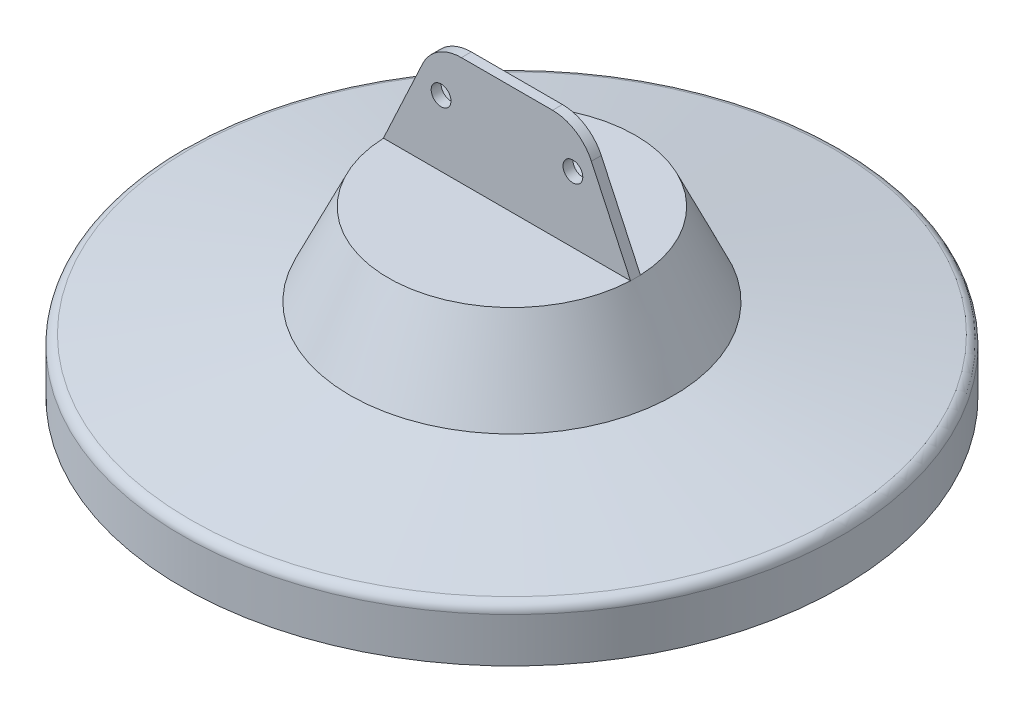
ISO-10303-21;
HEADER;
FILE_DESCRIPTION(('STEP AP214'),'2;1');
FILE_NAME('part.step','',(''),(''),'','','');
FILE_SCHEMA(('AUTOMOTIVE_DESIGN { 1 0 10303 214 1 1 1 1 }'));
ENDSEC;
DATA;
#1=APPLICATION_CONTEXT('core data for automotive mechanical design processes');
#2=APPLICATION_PROTOCOL_DEFINITION('international standard','automotive_design',2000,#1);
#3=PRODUCT_CONTEXT('',#1,'mechanical');
#4=PRODUCT('Part','Part','',(#3));
#5=PRODUCT_RELATED_PRODUCT_CATEGORY('part','',(#4));
#6=PRODUCT_DEFINITION_FORMATION('','',#4);
#7=PRODUCT_DEFINITION_CONTEXT('part definition',#1,'design');
#8=PRODUCT_DEFINITION('design','',#6,#7);
#9=PRODUCT_DEFINITION_SHAPE('','',#8);
#10=(LENGTH_UNIT() NAMED_UNIT(*) SI_UNIT(.MILLI.,.METRE.));
#11=(NAMED_UNIT(*) PLANE_ANGLE_UNIT() SI_UNIT($,.RADIAN.));
#12=(NAMED_UNIT(*) SI_UNIT($,.STERADIAN.) SOLID_ANGLE_UNIT());
#13=UNCERTAINTY_MEASURE_WITH_UNIT(LENGTH_MEASURE(1.E-05),#10,'distance_accuracy_value','');
#14=(GEOMETRIC_REPRESENTATION_CONTEXT(3) GLOBAL_UNCERTAINTY_ASSIGNED_CONTEXT((#13)) GLOBAL_UNIT_ASSIGNED_CONTEXT((#10,
#11,#12)) REPRESENTATION_CONTEXT('',''));
#15=CARTESIAN_POINT('',(0.,0.,0.));
#16=DIRECTION('',(0.,0.,1.));
#17=DIRECTION('',(1.,0.,0.));
#18=AXIS2_PLACEMENT_3D('',#15,#16,#17);
#19=CARTESIAN_POINT('',(-37.5,50.,0.));
#20=DIRECTION('',(0.,-1.,0.));
#21=DIRECTION('',(0.,0.,-1.));
#22=AXIS2_PLACEMENT_3D('',#19,#20,#21);
#23=PLANE('',#22);
#24=DIRECTION('',(1.,0.,0.));
#25=VECTOR('',#24,1.);
#26=CARTESIAN_POINT('',(-37.5,50.,1.5));
#27=LINE('',#26,#25);
#28=CARTESIAN_POINT('',(-37.4699879903904,50.,1.5));
#29=VERTEX_POINT('',#28);
#30=CARTESIAN_POINT('',(37.4699879903904,50.,1.5));
#31=VERTEX_POINT('',#30);
#32=EDGE_CURVE('E44',#29,#31,#27,.T.);
#33=ORIENTED_EDGE('',*,*,#32,.F.);
#34=CARTESIAN_POINT('',(0.,50.,0.));
#35=DIRECTION('',(0.,-1.,0.));
#36=DIRECTION('',(0.,0.,-1.));
#37=AXIS2_PLACEMENT_3D('',#34,#35,#36);
#38=CIRCLE('',#37,37.5);
#39=EDGE_CURVE('E164',#31,#29,#38,.T.);
#40=ORIENTED_EDGE('',*,*,#39,.F.);
#41=EDGE_LOOP('',(#33,#40));
#42=FACE_BOUND('',#41,.T.);
#43=ADVANCED_FACE('F35',(#42),#23,.F.);
#44=CARTESIAN_POINT('',(0.,0.,0.));
#45=DIRECTION('',(0.,1.,0.));
#46=DIRECTION('',(0.,0.,1.));
#47=AXIS2_PLACEMENT_3D('',#44,#45,#46);
#48=PLANE('',#47);
#49=CARTESIAN_POINT('',(0.,0.,0.));
#50=DIRECTION('',(0.,-1.,0.));
#51=DIRECTION('',(0.,0.,-1.));
#52=AXIS2_PLACEMENT_3D('',#49,#50,#51);
#53=CIRCLE('',#52,100.);
#54=CARTESIAN_POINT('',(0.,0.,-100.));
#55=VERTEX_POINT('',#54);
#56=EDGE_CURVE('E39',#55,#55,#53,.T.);
#57=ORIENTED_EDGE('',*,*,#56,.T.);
#58=EDGE_LOOP('',(#57));
#59=FACE_BOUND('',#58,.T.);
#60=ADVANCED_FACE('F37',(#59),#48,.F.);
#61=CARTESIAN_POINT('',(0.,0.,0.));
#62=DIRECTION('',(0.,-1.,0.));
#63=DIRECTION('',(0.,0.,-1.));
#64=AXIS2_PLACEMENT_3D('',#61,#62,#63);
#65=CYLINDRICAL_SURFACE('',#64,100.);
#66=ORIENTED_EDGE('',*,*,#56,.F.);
#67=EDGE_LOOP('',(#66));
#68=FACE_BOUND('',#67,.T.);
#69=CARTESIAN_POINT('',(0.,13.517830348282,0.));
#70=DIRECTION('',(0.,-1.,0.));
#71=DIRECTION('',(0.,0.,-1.));
#72=AXIS2_PLACEMENT_3D('',#69,#70,#71);
#73=CIRCLE('',#72,100.);
#74=CARTESIAN_POINT('',(0.,13.517830348282,-100.));
#75=VERTEX_POINT('',#74);
#76=EDGE_CURVE('E148',#75,#75,#73,.T.);
#77=ORIENTED_EDGE('',*,*,#76,.T.);
#78=EDGE_LOOP('',(#77));
#79=FACE_BOUND('',#78,.T.);
#80=ADVANCED_FACE('F242',(#68,#79),#65,.T.);
#81=CARTESIAN_POINT('',(0.,13.517830348282,0.));
#82=DIRECTION('',(0.,-1.,0.));
#83=DIRECTION('',(0.,0.,-1.));
#84=AXIS2_PLACEMENT_3D('',#81,#82,#83);
#85=TOROIDAL_SURFACE('',#84,97.,3.);
#86=ORIENTED_EDGE('',*,*,#76,.F.);
#87=EDGE_LOOP('',(#86));
#88=FACE_BOUND('',#87,.T.);
#89=CARTESIAN_POINT('',(0.,16.4722536073187,0.));
#90=DIRECTION('',(0.,-1.,0.));
#91=DIRECTION('',(0.,0.,-1.));
#92=AXIS2_PLACEMENT_3D('',#89,#90,#91);
#93=CIRCLE('',#92,97.5209445330008);
#94=CARTESIAN_POINT('',(0.,16.4722536073187,-97.5209445330008));
#95=VERTEX_POINT('',#94);
#96=EDGE_CURVE('E146',#95,#95,#93,.T.);
#97=ORIENTED_EDGE('',*,*,#96,.T.);
#98=EDGE_LOOP('',(#97));
#99=FACE_BOUND('',#98,.T.);
#100=ADVANCED_FACE('F257',(#88,#99),#85,.T.);
#101=CARTESIAN_POINT('',(0.,25.,0.));
#102=DIRECTION('',(0.,-1.,0.));
#103=DIRECTION('',(0.,0.,-1.));
#104=AXIS2_PLACEMENT_3D('',#101,#102,#103);
#105=CONICAL_SURFACE('',#104,49.1576914538748,1.39626340159547);
#106=ORIENTED_EDGE('',*,*,#96,.F.);
#107=EDGE_LOOP('',(#106));
#108=FACE_BOUND('',#107,.T.);
#109=CARTESIAN_POINT('',(0.,25.,0.));
#110=DIRECTION('',(0.,-1.,0.));
#111=DIRECTION('',(0.,0.,-1.));
#112=AXIS2_PLACEMENT_3D('',#109,#110,#111);
#113=CIRCLE('',#112,49.1576914538748);
#114=CARTESIAN_POINT('',(0.,25.,-49.1576914538748));
#115=VERTEX_POINT('',#114);
#116=EDGE_CURVE('E143',#115,#115,#113,.T.);
#117=ORIENTED_EDGE('',*,*,#116,.T.);
#118=EDGE_LOOP('',(#117));
#119=FACE_BOUND('',#118,.T.);
#120=ADVANCED_FACE('F252',(#108,#119),#105,.T.);
#121=CARTESIAN_POINT('',(0.,50.,0.));
#122=DIRECTION('',(0.,-1.,0.));
#123=DIRECTION('',(0.,0.,-1.));
#124=AXIS2_PLACEMENT_3D('',#121,#122,#123);
#125=CONICAL_SURFACE('',#124,37.5,0.436332312998576);
#126=ORIENTED_EDGE('',*,*,#116,.F.);
#127=EDGE_LOOP('',(#126));
#128=FACE_BOUND('',#127,.T.);
#129=CARTESIAN_POINT('',(37.4699879903904,50.,-1.5));
#130=VERTEX_POINT('',#129);
#131=CARTESIAN_POINT('',(37.5,50.,0.));
#132=VERTEX_POINT('',#131);
#133=EDGE_CURVE('E139',#130,#132,#38,.T.);
#134=ORIENTED_EDGE('',*,*,#133,.T.);
#135=EDGE_CURVE('E133',#132,#31,#38,.T.);
#136=ORIENTED_EDGE('',*,*,#135,.T.);
#137=ORIENTED_EDGE('',*,*,#39,.T.);
#138=CARTESIAN_POINT('',(-37.5,50.,0.));
#139=VERTEX_POINT('',#138);
#140=EDGE_CURVE('E59',#29,#139,#38,.T.);
#141=ORIENTED_EDGE('',*,*,#140,.T.);
#142=CARTESIAN_POINT('',(-37.4699879903904,50.,-1.5));
#143=VERTEX_POINT('',#142);
#144=EDGE_CURVE('E137',#139,#143,#38,.T.);
#145=ORIENTED_EDGE('',*,*,#144,.T.);
#146=EDGE_CURVE('E52',#143,#130,#38,.T.);
#147=ORIENTED_EDGE('',*,*,#146,.T.);
#148=EDGE_LOOP('',(#134,#136,#137,#141,#145,#147));
#149=FACE_BOUND('',#148,.T.);
#150=ADVANCED_FACE('F166',(#128,#149),#125,.T.);
#151=ORIENTED_EDGE('',*,*,#146,.F.);
#152=DIRECTION('',(1.,0.,0.));
#153=VECTOR('',#152,1.);
#154=CARTESIAN_POINT('',(-37.5,50.,-1.5));
#155=LINE('',#154,#153);
#156=EDGE_CURVE('E11',#143,#130,#155,.T.);
#157=ORIENTED_EDGE('',*,*,#156,.T.);
#158=EDGE_LOOP('',(#151,#157));
#159=FACE_BOUND('',#158,.T.);
#160=ADVANCED_FACE('F238',(#159),#23,.F.);
#161=CARTESIAN_POINT('',(-37.5,50.,1.5));
#162=DIRECTION('',(0.,1.,0.));
#163=DIRECTION('',(0.,0.,1.));
#164=AXIS2_PLACEMENT_3D('',#161,#162,#163);
#165=PLANE('',#164);
#166=ORIENTED_EDGE('',*,*,#133,.F.);
#167=CARTESIAN_POINT('',(37.5,50.,-1.5));
#168=VERTEX_POINT('',#167);
#169=EDGE_CURVE('E47',#130,#168,#155,.T.);
#170=ORIENTED_EDGE('',*,*,#169,.T.);
#171=DIRECTION('',(0.,0.,-1.));
#172=VECTOR('',#171,1.);
#173=CARTESIAN_POINT('',(37.5,50.,1.5));
#174=LINE('',#173,#172);
#175=EDGE_CURVE('E135',#132,#168,#174,.T.);
#176=ORIENTED_EDGE('',*,*,#175,.F.);
#177=EDGE_LOOP('',(#166,#170,#176));
#178=FACE_BOUND('',#177,.T.);
#179=ADVANCED_FACE('F246',(#178),#165,.F.);
#180=ORIENTED_EDGE('',*,*,#135,.F.);
#181=CARTESIAN_POINT('',(37.5,50.,1.5));
#182=VERTEX_POINT('',#181);
#183=EDGE_CURVE('E126',#182,#132,#174,.T.);
#184=ORIENTED_EDGE('',*,*,#183,.F.);
#185=EDGE_CURVE('E110',#31,#182,#27,.T.);
#186=ORIENTED_EDGE('',*,*,#185,.F.);
#187=EDGE_LOOP('',(#180,#184,#186));
#188=FACE_BOUND('',#187,.T.);
#189=ADVANCED_FACE('F132',(#188),#165,.F.);
#190=ORIENTED_EDGE('',*,*,#140,.F.);
#191=CARTESIAN_POINT('',(-37.5,50.,1.5));
#192=VERTEX_POINT('',#191);
#193=EDGE_CURVE('E120',#192,#29,#27,.T.);
#194=ORIENTED_EDGE('',*,*,#193,.F.);
#195=DIRECTION('',(0.,0.,-1.));
#196=VECTOR('',#195,1.);
#197=CARTESIAN_POINT('',(-37.5,50.,1.5));
#198=LINE('',#197,#196);
#199=EDGE_CURVE('E163',#192,#139,#198,.T.);
#200=ORIENTED_EDGE('',*,*,#199,.T.);
#201=EDGE_LOOP('',(#190,#194,#200));
#202=FACE_BOUND('',#201,.T.);
#203=ADVANCED_FACE('F162',(#202),#165,.F.);
#204=CARTESIAN_POINT('',(13.8299338903878,70.,1.5));
#205=DIRECTION('',(0.,0.,-1.));
#206=DIRECTION('',(-1.,0.,0.));
#207=AXIS2_PLACEMENT_3D('',#204,#205,#206);
#208=PLANE('',#207);
#209=ORIENTED_EDGE('',*,*,#193,.T.);
#210=ORIENTED_EDGE('',*,*,#32,.T.);
#211=ORIENTED_EDGE('',*,*,#185,.T.);
#212=DIRECTION('',(-0.422618261740693,0.906307787036653,0.));
#213=VECTOR('',#212,1.);
#214=CARTESIAN_POINT('',(25.6119351218644,75.4940374026289,1.5));
#215=LINE('',#214,#213);
#216=CARTESIAN_POINT('',(25.6119351218644,75.4940374026289,1.5));
#217=VERTEX_POINT('',#216);
#218=EDGE_CURVE('E115',#182,#217,#215,.T.);
#219=ORIENTED_EDGE('',*,*,#218,.T.);
#220=CARTESIAN_POINT('',(13.8299338903878,70.,1.5));
#221=DIRECTION('',(0.,0.,1.));
#222=DIRECTION('',(-1.,0.,0.));
#223=AXIS2_PLACEMENT_3D('',#220,#221,#222);
#224=CIRCLE('',#223,13.);
#225=CARTESIAN_POINT('',(13.8299338903878,83.,1.5));
#226=VERTEX_POINT('',#225);
#227=EDGE_CURVE('E130',#217,#226,#224,.T.);
#228=ORIENTED_EDGE('',*,*,#227,.T.);
#229=DIRECTION('',(-1.,0.,0.));
#230=VECTOR('',#229,1.);
#231=CARTESIAN_POINT('',(-13.8299338903878,83.,1.5));
#232=LINE('',#231,#230);
#233=CARTESIAN_POINT('',(-13.8299338903878,83.,1.5));
#234=VERTEX_POINT('',#233);
#235=EDGE_CURVE('E218',#226,#234,#232,.T.);
#236=ORIENTED_EDGE('',*,*,#235,.T.);
#237=CARTESIAN_POINT('',(-13.8299338903878,70.,1.5));
#238=DIRECTION('',(0.,0.,1.));
#239=DIRECTION('',(-1.,0.,0.));
#240=AXIS2_PLACEMENT_3D('',#237,#238,#239);
#241=CIRCLE('',#240,13.);
#242=CARTESIAN_POINT('',(-25.6119351218644,75.4940374026289,1.5));
#243=VERTEX_POINT('',#242);
#244=EDGE_CURVE('E217',#234,#243,#241,.T.);
#245=ORIENTED_EDGE('',*,*,#244,.T.);
#246=DIRECTION('',(-0.422618261740693,-0.906307787036653,0.));
#247=VECTOR('',#246,1.);
#248=CARTESIAN_POINT('',(-37.5,50.,1.5));
#249=LINE('',#248,#247);
#250=EDGE_CURVE('E158',#243,#192,#249,.T.);
#251=ORIENTED_EDGE('',*,*,#250,.T.);
#252=EDGE_LOOP('',(#209,#210,#211,#219,#228,#236,#245,#251));
#253=FACE_BOUND('',#252,.T.);
#254=CARTESIAN_POINT('',(-20.,70.,1.5));
#255=DIRECTION('',(0.,0.,1.));
#256=DIRECTION('',(1.,0.,0.));
#257=AXIS2_PLACEMENT_3D('',#254,#255,#256);
#258=CIRCLE('',#257,3.);
#259=CARTESIAN_POINT('',(-17.,70.,1.5));
#260=VERTEX_POINT('',#259);
#261=EDGE_CURVE('E185',#260,#260,#258,.T.);
#262=ORIENTED_EDGE('',*,*,#261,.F.);
#263=EDGE_LOOP('',(#262));
#264=FACE_BOUND('',#263,.T.);
#265=CARTESIAN_POINT('',(20.,70.,1.5));
#266=DIRECTION('',(0.,0.,1.));
#267=DIRECTION('',(1.,0.,0.));
#268=AXIS2_PLACEMENT_3D('',#265,#266,#267);
#269=CIRCLE('',#268,3.);
#270=CARTESIAN_POINT('',(23.,70.,1.5));
#271=VERTEX_POINT('',#270);
#272=EDGE_CURVE('E389',#271,#271,#269,.T.);
#273=ORIENTED_EDGE('',*,*,#272,.F.);
#274=EDGE_LOOP('',(#273));
#275=FACE_BOUND('',#274,.T.);
#276=ADVANCED_FACE('F113',(#253,#264,#275),#208,.F.);
#277=CARTESIAN_POINT('',(13.8299338903878,70.,-1.5));
#278=DIRECTION('',(0.,0.,-1.));
#279=DIRECTION('',(-1.,0.,0.));
#280=AXIS2_PLACEMENT_3D('',#277,#278,#279);
#281=PLANE('',#280);
#282=CARTESIAN_POINT('',(-20.,70.,-1.5));
#283=DIRECTION('',(0.,0.,1.));
#284=DIRECTION('',(1.,0.,0.));
#285=AXIS2_PLACEMENT_3D('',#282,#283,#284);
#286=CIRCLE('',#285,3.);
#287=CARTESIAN_POINT('',(-17.,70.,-1.5));
#288=VERTEX_POINT('',#287);
#289=EDGE_CURVE('E394',#288,#288,#286,.T.);
#290=ORIENTED_EDGE('',*,*,#289,.T.);
#291=EDGE_LOOP('',(#290));
#292=FACE_BOUND('',#291,.T.);
#293=CARTESIAN_POINT('',(-37.5,50.,-1.5));
#294=VERTEX_POINT('',#293);
#295=EDGE_CURVE('E46',#294,#143,#155,.T.);
#296=ORIENTED_EDGE('',*,*,#295,.F.);
#297=DIRECTION('',(-0.422618261740693,-0.906307787036653,0.));
#298=VECTOR('',#297,1.);
#299=CARTESIAN_POINT('',(-37.5,50.,-1.5));
#300=LINE('',#299,#298);
#301=CARTESIAN_POINT('',(-25.6119351218644,75.4940374026289,-1.5));
#302=VERTEX_POINT('',#301);
#303=EDGE_CURVE('E121',#302,#294,#300,.T.);
#304=ORIENTED_EDGE('',*,*,#303,.F.);
#305=CARTESIAN_POINT('',(-13.8299338903878,70.,-1.5));
#306=DIRECTION('',(0.,0.,1.));
#307=DIRECTION('',(-1.,0.,0.));
#308=AXIS2_PLACEMENT_3D('',#305,#306,#307);
#309=CIRCLE('',#308,13.);
#310=CARTESIAN_POINT('',(-13.8299338903878,83.,-1.5));
#311=VERTEX_POINT('',#310);
#312=EDGE_CURVE('E192',#311,#302,#309,.T.);
#313=ORIENTED_EDGE('',*,*,#312,.F.);
#314=DIRECTION('',(-1.,0.,0.));
#315=VECTOR('',#314,1.);
#316=CARTESIAN_POINT('',(-13.8299338903878,83.,-1.5));
#317=LINE('',#316,#315);
#318=CARTESIAN_POINT('',(13.8299338903878,83.,-1.5));
#319=VERTEX_POINT('',#318);
#320=EDGE_CURVE('E190',#319,#311,#317,.T.);
#321=ORIENTED_EDGE('',*,*,#320,.F.);
#322=CARTESIAN_POINT('',(13.8299338903878,70.,-1.5));
#323=DIRECTION('',(0.,0.,1.));
#324=DIRECTION('',(-1.,0.,0.));
#325=AXIS2_PLACEMENT_3D('',#322,#323,#324);
#326=CIRCLE('',#325,13.);
#327=CARTESIAN_POINT('',(25.6119351218644,75.4940374026289,-1.5));
#328=VERTEX_POINT('',#327);
#329=EDGE_CURVE('E183',#328,#319,#326,.T.);
#330=ORIENTED_EDGE('',*,*,#329,.F.);
#331=DIRECTION('',(-0.422618261740693,0.906307787036653,0.));
#332=VECTOR('',#331,1.);
#333=CARTESIAN_POINT('',(25.6119351218644,75.4940374026289,-1.5));
#334=LINE('',#333,#332);
#335=EDGE_CURVE('E182',#168,#328,#334,.T.);
#336=ORIENTED_EDGE('',*,*,#335,.F.);
#337=ORIENTED_EDGE('',*,*,#169,.F.);
#338=ORIENTED_EDGE('',*,*,#156,.F.);
#339=EDGE_LOOP('',(#296,#304,#313,#321,#330,#336,#337,#338));
#340=FACE_BOUND('',#339,.T.);
#341=CARTESIAN_POINT('',(20.,70.,-1.5));
#342=DIRECTION('',(0.,0.,1.));
#343=DIRECTION('',(1.,0.,0.));
#344=AXIS2_PLACEMENT_3D('',#341,#342,#343);
#345=CIRCLE('',#344,3.);
#346=CARTESIAN_POINT('',(23.,70.,-1.5));
#347=VERTEX_POINT('',#346);
#348=EDGE_CURVE('E392',#347,#347,#345,.T.);
#349=ORIENTED_EDGE('',*,*,#348,.T.);
#350=EDGE_LOOP('',(#349));
#351=FACE_BOUND('',#350,.T.);
#352=ADVANCED_FACE('F174',(#292,#340,#351),#281,.T.);
#353=ORIENTED_EDGE('',*,*,#144,.F.);
#354=EDGE_CURVE('E180',#139,#294,#198,.T.);
#355=ORIENTED_EDGE('',*,*,#354,.T.);
#356=ORIENTED_EDGE('',*,*,#295,.T.);
#357=EDGE_LOOP('',(#353,#355,#356));
#358=FACE_BOUND('',#357,.T.);
#359=ADVANCED_FACE('F179',(#358),#165,.F.);
#360=CARTESIAN_POINT('',(25.6119351218644,75.4940374026289,1.5));
#361=DIRECTION('',(-0.906307787036653,-0.422618261740693,0.));
#362=DIRECTION('',(0.422618261740693,-0.906307787036653,0.));
#363=AXIS2_PLACEMENT_3D('',#360,#361,#362);
#364=PLANE('',#363);
#365=ORIENTED_EDGE('',*,*,#335,.T.);
#366=DIRECTION('',(0.,0.,-1.));
#367=VECTOR('',#366,1.);
#368=CARTESIAN_POINT('',(25.6119351218644,75.4940374026289,1.5));
#369=LINE('',#368,#367);
#370=EDGE_CURVE('E128',#217,#328,#369,.T.);
#371=ORIENTED_EDGE('',*,*,#370,.F.);
#372=ORIENTED_EDGE('',*,*,#218,.F.);
#373=ORIENTED_EDGE('',*,*,#183,.T.);
#374=ORIENTED_EDGE('',*,*,#175,.T.);
#375=EDGE_LOOP('',(#365,#371,#372,#373,#374));
#376=FACE_BOUND('',#375,.T.);
#377=ADVANCED_FACE('F125',(#376),#364,.F.);
#378=CARTESIAN_POINT('',(13.8299338903878,70.,1.5));
#379=DIRECTION('',(0.,0.,-1.));
#380=DIRECTION('',(-1.,0.,0.));
#381=AXIS2_PLACEMENT_3D('',#378,#379,#380);
#382=CYLINDRICAL_SURFACE('',#381,13.);
#383=ORIENTED_EDGE('',*,*,#329,.T.);
#384=DIRECTION('',(0.,0.,-1.));
#385=VECTOR('',#384,1.);
#386=CARTESIAN_POINT('',(13.8299338903878,83.,1.5));
#387=LINE('',#386,#385);
#388=EDGE_CURVE('E201',#226,#319,#387,.T.);
#389=ORIENTED_EDGE('',*,*,#388,.F.);
#390=ORIENTED_EDGE('',*,*,#227,.F.);
#391=ORIENTED_EDGE('',*,*,#370,.T.);
#392=EDGE_LOOP('',(#383,#389,#390,#391));
#393=FACE_BOUND('',#392,.T.);
#394=ADVANCED_FACE('F209',(#393),#382,.T.);
#395=CARTESIAN_POINT('',(-13.8299338903878,83.,1.5));
#396=DIRECTION('',(0.,-1.,0.));
#397=DIRECTION('',(0.,0.,-1.));
#398=AXIS2_PLACEMENT_3D('',#395,#396,#397);
#399=PLANE('',#398);
#400=ORIENTED_EDGE('',*,*,#320,.T.);
#401=DIRECTION('',(0.,0.,-1.));
#402=VECTOR('',#401,1.);
#403=CARTESIAN_POINT('',(-13.8299338903878,83.,1.5));
#404=LINE('',#403,#402);
#405=EDGE_CURVE('E199',#234,#311,#404,.T.);
#406=ORIENTED_EDGE('',*,*,#405,.F.);
#407=ORIENTED_EDGE('',*,*,#235,.F.);
#408=ORIENTED_EDGE('',*,*,#388,.T.);
#409=EDGE_LOOP('',(#400,#406,#407,#408));
#410=FACE_BOUND('',#409,.T.);
#411=ADVANCED_FACE('F212',(#410),#399,.F.);
#412=CARTESIAN_POINT('',(-13.8299338903878,70.,1.5));
#413=DIRECTION('',(0.,0.,-1.));
#414=DIRECTION('',(-1.,0.,0.));
#415=AXIS2_PLACEMENT_3D('',#412,#413,#414);
#416=CYLINDRICAL_SURFACE('',#415,13.);
#417=ORIENTED_EDGE('',*,*,#312,.T.);
#418=DIRECTION('',(0.,0.,-1.));
#419=VECTOR('',#418,1.);
#420=CARTESIAN_POINT('',(-25.6119351218644,75.4940374026289,1.5));
#421=LINE('',#420,#419);
#422=EDGE_CURVE('E196',#243,#302,#421,.T.);
#423=ORIENTED_EDGE('',*,*,#422,.F.);
#424=ORIENTED_EDGE('',*,*,#244,.F.);
#425=ORIENTED_EDGE('',*,*,#405,.T.);
#426=EDGE_LOOP('',(#417,#423,#424,#425));
#427=FACE_BOUND('',#426,.T.);
#428=ADVANCED_FACE('F215',(#427),#416,.T.);
#429=CARTESIAN_POINT('',(-37.5,50.,1.5));
#430=DIRECTION('',(0.906307787036653,-0.422618261740693,0.));
#431=DIRECTION('',(0.422618261740693,0.906307787036653,0.));
#432=AXIS2_PLACEMENT_3D('',#429,#430,#431);
#433=PLANE('',#432);
#434=ORIENTED_EDGE('',*,*,#303,.T.);
#435=ORIENTED_EDGE('',*,*,#354,.F.);
#436=ORIENTED_EDGE('',*,*,#199,.F.);
#437=ORIENTED_EDGE('',*,*,#250,.F.);
#438=ORIENTED_EDGE('',*,*,#422,.T.);
#439=EDGE_LOOP('',(#434,#435,#436,#437,#438));
#440=FACE_BOUND('',#439,.T.);
#441=ADVANCED_FACE('F222',(#440),#433,.F.);
#442=CARTESIAN_POINT('',(-20.,70.,1.5));
#443=DIRECTION('',(0.,0.,-1.));
#444=DIRECTION('',(-1.,0.,0.));
#445=AXIS2_PLACEMENT_3D('',#442,#443,#444);
#446=CYLINDRICAL_SURFACE('',#445,3.);
#447=ORIENTED_EDGE('',*,*,#261,.T.);
#448=EDGE_LOOP('',(#447));
#449=FACE_BOUND('',#448,.T.);
#450=ORIENTED_EDGE('',*,*,#289,.F.);
#451=EDGE_LOOP('',(#450));
#452=FACE_BOUND('',#451,.T.);
#453=ADVANCED_FACE('F224',(#449,#452),#446,.F.);
#454=CARTESIAN_POINT('',(20.,70.,1.5));
#455=DIRECTION('',(0.,0.,-1.));
#456=DIRECTION('',(-1.,0.,0.));
#457=AXIS2_PLACEMENT_3D('',#454,#455,#456);
#458=CYLINDRICAL_SURFACE('',#457,3.);
#459=ORIENTED_EDGE('',*,*,#272,.T.);
#460=EDGE_LOOP('',(#459));
#461=FACE_BOUND('',#460,.T.);
#462=ORIENTED_EDGE('',*,*,#348,.F.);
#463=EDGE_LOOP('',(#462));
#464=FACE_BOUND('',#463,.T.);
#465=ADVANCED_FACE('F230',(#461,#464),#458,.F.);
#466=CLOSED_SHELL('',(#43,#60,#80,#100,#120,#150,#160,#179,#189,#203,#276,#352,#359,#377,#394,
#411,#428,#441,#453,#465));
#467=MANIFOLD_SOLID_BREP('B2',#466);
#468=ADVANCED_BREP_SHAPE_REPRESENTATION('',(#18,#467),#14);
#469=SHAPE_DEFINITION_REPRESENTATION(#9,#468);
ENDSEC;
END-ISO-10303-21;
